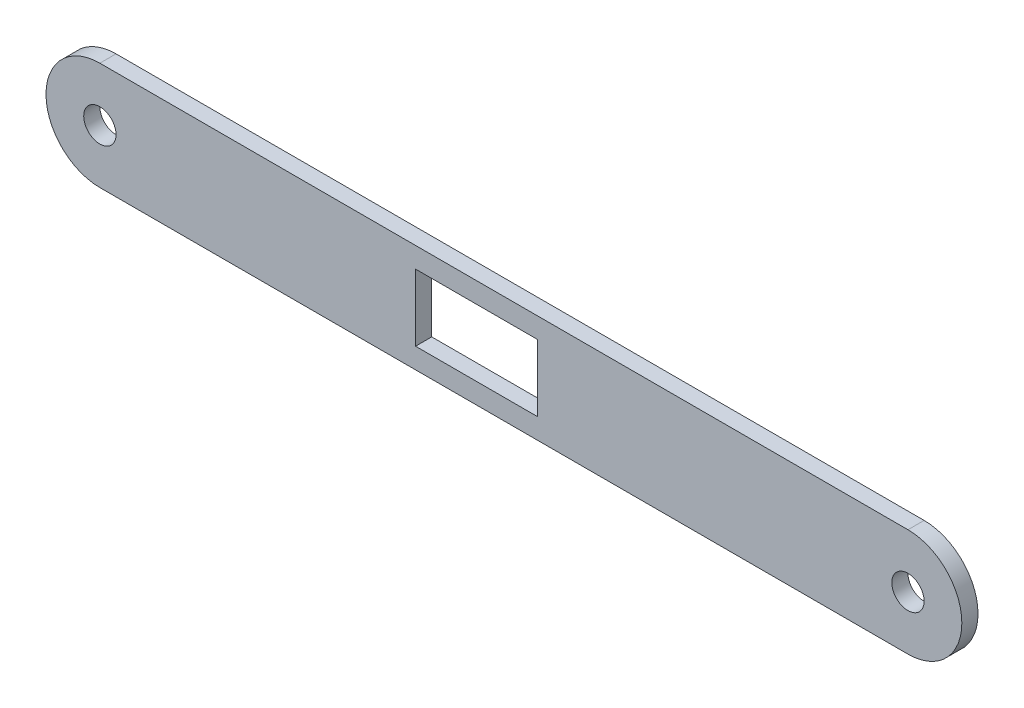
ISO-10303-21;
HEADER;
FILE_DESCRIPTION(('STEP AP214'),'2;1');
FILE_NAME('part.step','',(''),(''),'','','');
FILE_SCHEMA(('AUTOMOTIVE_DESIGN { 1 0 10303 214 1 1 1 1 }'));
ENDSEC;
DATA;
#1=APPLICATION_CONTEXT('core data for automotive mechanical design processes');
#2=APPLICATION_PROTOCOL_DEFINITION('international standard','automotive_design',2000,#1);
#3=PRODUCT_CONTEXT('',#1,'mechanical');
#4=PRODUCT('Part','Part','',(#3));
#5=PRODUCT_RELATED_PRODUCT_CATEGORY('part','',(#4));
#6=PRODUCT_DEFINITION_FORMATION('','',#4);
#7=PRODUCT_DEFINITION_CONTEXT('part definition',#1,'design');
#8=PRODUCT_DEFINITION('design','',#6,#7);
#9=PRODUCT_DEFINITION_SHAPE('','',#8);
#10=(LENGTH_UNIT() NAMED_UNIT(*) SI_UNIT(.MILLI.,.METRE.));
#11=(NAMED_UNIT(*) PLANE_ANGLE_UNIT() SI_UNIT($,.RADIAN.));
#12=(NAMED_UNIT(*) SI_UNIT($,.STERADIAN.) SOLID_ANGLE_UNIT());
#13=UNCERTAINTY_MEASURE_WITH_UNIT(LENGTH_MEASURE(1.E-05),#10,'distance_accuracy_value','');
#14=(GEOMETRIC_REPRESENTATION_CONTEXT(3) GLOBAL_UNCERTAINTY_ASSIGNED_CONTEXT((#13)) GLOBAL_UNIT_ASSIGNED_CONTEXT((#10,
#11,#12)) REPRESENTATION_CONTEXT('',''));
#15=CARTESIAN_POINT('',(0.,0.,0.));
#16=DIRECTION('',(0.,0.,1.));
#17=DIRECTION('',(1.,0.,0.));
#18=AXIS2_PLACEMENT_3D('',#15,#16,#17);
#19=CARTESIAN_POINT('',(75.,0.,3.));
#20=DIRECTION('',(0.,0.,1.));
#21=DIRECTION('',(1.,0.,0.));
#22=AXIS2_PLACEMENT_3D('',#19,#20,#21);
#23=PLANE('',#22);
#24=CARTESIAN_POINT('',(75.,0.,3.));
#25=DIRECTION('',(0.,0.,1.));
#26=DIRECTION('',(1.,0.,0.));
#27=AXIS2_PLACEMENT_3D('',#24,#25,#26);
#28=CIRCLE('',#27,3.00000000000001);
#29=CARTESIAN_POINT('',(78.,0.,3.));
#30=VERTEX_POINT('',#29);
#31=EDGE_CURVE('E167',#30,#30,#28,.T.);
#32=ORIENTED_EDGE('',*,*,#31,.F.);
#33=EDGE_LOOP('',(#32));
#34=FACE_BOUND('',#33,.T.);
#35=CARTESIAN_POINT('',(75.,0.,3.));
#36=DIRECTION('',(0.,0.,1.));
#37=DIRECTION('',(1.,0.,0.));
#38=AXIS2_PLACEMENT_3D('',#35,#36,#37);
#39=CIRCLE('',#38,10.);
#40=CARTESIAN_POINT('',(75.,-9.99999999999997,3.));
#41=VERTEX_POINT('',#40);
#42=CARTESIAN_POINT('',(75.,10.,3.));
#43=VERTEX_POINT('',#42);
#44=EDGE_CURVE('E175',#41,#43,#39,.T.);
#45=ORIENTED_EDGE('',*,*,#44,.T.);
#46=DIRECTION('',(-1.,0.,0.));
#47=VECTOR('',#46,1.);
#48=CARTESIAN_POINT('',(75.,10.,3.));
#49=LINE('',#48,#47);
#50=CARTESIAN_POINT('',(-75.,10.,3.));
#51=VERTEX_POINT('',#50);
#52=EDGE_CURVE('E179',#43,#51,#49,.T.);
#53=ORIENTED_EDGE('',*,*,#52,.T.);
#54=CARTESIAN_POINT('',(-75.,0.,3.));
#55=DIRECTION('',(0.,0.,1.));
#56=DIRECTION('',(1.,0.,0.));
#57=AXIS2_PLACEMENT_3D('',#54,#55,#56);
#58=CIRCLE('',#57,10.);
#59=CARTESIAN_POINT('',(-75.,-9.99999999999999,3.));
#60=VERTEX_POINT('',#59);
#61=EDGE_CURVE('E183',#51,#60,#58,.T.);
#62=ORIENTED_EDGE('',*,*,#61,.T.);
#63=DIRECTION('',(1.,0.,0.));
#64=VECTOR('',#63,1.);
#65=CARTESIAN_POINT('',(75.,-9.99999999999997,3.));
#66=LINE('',#65,#64);
#67=EDGE_CURVE('E186',#60,#41,#66,.T.);
#68=ORIENTED_EDGE('',*,*,#67,.T.);
#69=EDGE_LOOP('',(#45,#53,#62,#68));
#70=FACE_BOUND('',#69,.T.);
#71=CARTESIAN_POINT('',(-75.,0.,3.));
#72=DIRECTION('',(0.,0.,1.));
#73=DIRECTION('',(-1.,0.,0.));
#74=AXIS2_PLACEMENT_3D('',#71,#72,#73);
#75=CIRCLE('',#74,3.00000000000001);
#76=CARTESIAN_POINT('',(-78.,0.,3.));
#77=VERTEX_POINT('',#76);
#78=EDGE_CURVE('E159',#77,#77,#75,.T.);
#79=ORIENTED_EDGE('',*,*,#78,.F.);
#80=EDGE_LOOP('',(#79));
#81=FACE_BOUND('',#80,.T.);
#82=DIRECTION('',(-1.,0.,0.));
#83=VECTOR('',#82,1.);
#84=CARTESIAN_POINT('',(-16.4,6.2,3.));
#85=LINE('',#84,#83);
#86=CARTESIAN_POINT('',(6.2,6.2,3.));
#87=VERTEX_POINT('',#86);
#88=CARTESIAN_POINT('',(-16.4,6.2,3.));
#89=VERTEX_POINT('',#88);
#90=EDGE_CURVE('E118',#87,#89,#85,.T.);
#91=ORIENTED_EDGE('',*,*,#90,.F.);
#92=DIRECTION('',(0.,1.,0.));
#93=VECTOR('',#92,1.);
#94=CARTESIAN_POINT('',(6.2,6.2,3.));
#95=LINE('',#94,#93);
#96=CARTESIAN_POINT('',(6.2,-6.2,3.));
#97=VERTEX_POINT('',#96);
#98=EDGE_CURVE('E109',#97,#87,#95,.T.);
#99=ORIENTED_EDGE('',*,*,#98,.F.);
#100=DIRECTION('',(1.,0.,0.));
#101=VECTOR('',#100,1.);
#102=CARTESIAN_POINT('',(-16.4,-6.2,3.));
#103=LINE('',#102,#101);
#104=CARTESIAN_POINT('',(-16.4,-6.2,3.));
#105=VERTEX_POINT('',#104);
#106=EDGE_CURVE('E137',#105,#97,#103,.T.);
#107=ORIENTED_EDGE('',*,*,#106,.F.);
#108=DIRECTION('',(0.,-1.,0.));
#109=VECTOR('',#108,1.);
#110=CARTESIAN_POINT('',(-16.4,6.2,3.));
#111=LINE('',#110,#109);
#112=EDGE_CURVE('E131',#89,#105,#111,.T.);
#113=ORIENTED_EDGE('',*,*,#112,.F.);
#114=EDGE_LOOP('',(#91,#99,#107,#113));
#115=FACE_BOUND('',#114,.T.);
#116=ADVANCED_FACE('F43',(#34,#70,#81,#115),#23,.T.);
#117=CARTESIAN_POINT('',(75.,0.,0.));
#118=DIRECTION('',(0.,0.,1.));
#119=DIRECTION('',(1.,0.,0.));
#120=AXIS2_PLACEMENT_3D('',#117,#118,#119);
#121=PLANE('',#120);
#122=CARTESIAN_POINT('',(-75.,0.,0.));
#123=DIRECTION('',(0.,0.,1.));
#124=DIRECTION('',(-1.,0.,0.));
#125=AXIS2_PLACEMENT_3D('',#122,#123,#124);
#126=CIRCLE('',#125,3.00000000000001);
#127=CARTESIAN_POINT('',(-78.,0.,0.));
#128=VERTEX_POINT('',#127);
#129=EDGE_CURVE('E127',#128,#128,#126,.T.);
#130=ORIENTED_EDGE('',*,*,#129,.T.);
#131=EDGE_LOOP('',(#130));
#132=FACE_BOUND('',#131,.T.);
#133=CARTESIAN_POINT('',(75.,0.,0.));
#134=DIRECTION('',(0.,0.,1.));
#135=DIRECTION('',(1.,0.,0.));
#136=AXIS2_PLACEMENT_3D('',#133,#134,#135);
#137=CIRCLE('',#136,3.00000000000001);
#138=CARTESIAN_POINT('',(78.,0.,0.));
#139=VERTEX_POINT('',#138);
#140=EDGE_CURVE('E163',#139,#139,#137,.T.);
#141=ORIENTED_EDGE('',*,*,#140,.T.);
#142=EDGE_LOOP('',(#141));
#143=FACE_BOUND('',#142,.T.);
#144=CARTESIAN_POINT('',(75.,0.,0.));
#145=DIRECTION('',(0.,0.,1.));
#146=DIRECTION('',(1.,0.,0.));
#147=AXIS2_PLACEMENT_3D('',#144,#145,#146);
#148=CIRCLE('',#147,10.);
#149=CARTESIAN_POINT('',(75.,-9.99999999999997,0.));
#150=VERTEX_POINT('',#149);
#151=CARTESIAN_POINT('',(75.,10.,0.));
#152=VERTEX_POINT('',#151);
#153=EDGE_CURVE('E171',#150,#152,#148,.T.);
#154=ORIENTED_EDGE('',*,*,#153,.F.);
#155=DIRECTION('',(1.,0.,0.));
#156=VECTOR('',#155,1.);
#157=CARTESIAN_POINT('',(75.,-9.99999999999997,0.));
#158=LINE('',#157,#156);
#159=CARTESIAN_POINT('',(-75.,-9.99999999999999,0.));
#160=VERTEX_POINT('',#159);
#161=EDGE_CURVE('E180',#160,#150,#158,.T.);
#162=ORIENTED_EDGE('',*,*,#161,.F.);
#163=CARTESIAN_POINT('',(-75.,0.,0.));
#164=DIRECTION('',(0.,0.,1.));
#165=DIRECTION('',(1.,0.,0.));
#166=AXIS2_PLACEMENT_3D('',#163,#164,#165);
#167=CIRCLE('',#166,10.);
#168=CARTESIAN_POINT('',(-75.,10.,0.));
#169=VERTEX_POINT('',#168);
#170=EDGE_CURVE('E196',#169,#160,#167,.T.);
#171=ORIENTED_EDGE('',*,*,#170,.F.);
#172=DIRECTION('',(-1.,0.,0.));
#173=VECTOR('',#172,1.);
#174=CARTESIAN_POINT('',(75.,10.,0.));
#175=LINE('',#174,#173);
#176=EDGE_CURVE('E193',#152,#169,#175,.T.);
#177=ORIENTED_EDGE('',*,*,#176,.F.);
#178=EDGE_LOOP('',(#154,#162,#171,#177));
#179=FACE_BOUND('',#178,.T.);
#180=DIRECTION('',(0.,1.,0.));
#181=VECTOR('',#180,1.);
#182=CARTESIAN_POINT('',(6.2,6.2,0.));
#183=LINE('',#182,#181);
#184=CARTESIAN_POINT('',(6.2,-6.2,0.));
#185=VERTEX_POINT('',#184);
#186=CARTESIAN_POINT('',(6.2,6.2,0.));
#187=VERTEX_POINT('',#186);
#188=EDGE_CURVE('E67',#185,#187,#183,.T.);
#189=ORIENTED_EDGE('',*,*,#188,.T.);
#190=DIRECTION('',(-1.,0.,0.));
#191=VECTOR('',#190,1.);
#192=CARTESIAN_POINT('',(-16.4,6.2,0.));
#193=LINE('',#192,#191);
#194=CARTESIAN_POINT('',(-16.4,6.2,0.));
#195=VERTEX_POINT('',#194);
#196=EDGE_CURVE('E125',#187,#195,#193,.T.);
#197=ORIENTED_EDGE('',*,*,#196,.T.);
#198=DIRECTION('',(0.,-1.,0.));
#199=VECTOR('',#198,1.);
#200=CARTESIAN_POINT('',(-16.4,6.2,0.));
#201=LINE('',#200,#199);
#202=CARTESIAN_POINT('',(-16.4,-6.2,0.));
#203=VERTEX_POINT('',#202);
#204=EDGE_CURVE('E146',#195,#203,#201,.T.);
#205=ORIENTED_EDGE('',*,*,#204,.T.);
#206=DIRECTION('',(1.,0.,0.));
#207=VECTOR('',#206,1.);
#208=CARTESIAN_POINT('',(-16.4,-6.2,0.));
#209=LINE('',#208,#207);
#210=EDGE_CURVE('E119',#203,#185,#209,.T.);
#211=ORIENTED_EDGE('',*,*,#210,.T.);
#212=EDGE_LOOP('',(#189,#197,#205,#211));
#213=FACE_BOUND('',#212,.T.);
#214=ADVANCED_FACE('F221',(#132,#143,#179,#213),#121,.F.);
#215=CARTESIAN_POINT('',(75.,0.,3.));
#216=DIRECTION('',(0.,0.,-1.));
#217=DIRECTION('',(-1.,0.,0.));
#218=AXIS2_PLACEMENT_3D('',#215,#216,#217);
#219=CYLINDRICAL_SURFACE('',#218,10.);
#220=ORIENTED_EDGE('',*,*,#153,.T.);
#221=DIRECTION('',(0.,0.,-1.));
#222=VECTOR('',#221,1.);
#223=CARTESIAN_POINT('',(75.,10.,3.));
#224=LINE('',#223,#222);
#225=EDGE_CURVE('E11',#43,#152,#224,.T.);
#226=ORIENTED_EDGE('',*,*,#225,.F.);
#227=ORIENTED_EDGE('',*,*,#44,.F.);
#228=DIRECTION('',(0.,0.,-1.));
#229=VECTOR('',#228,1.);
#230=CARTESIAN_POINT('',(75.,-9.99999999999997,3.));
#231=LINE('',#230,#229);
#232=EDGE_CURVE('E189',#41,#150,#231,.T.);
#233=ORIENTED_EDGE('',*,*,#232,.T.);
#234=EDGE_LOOP('',(#220,#226,#227,#233));
#235=FACE_BOUND('',#234,.T.);
#236=ADVANCED_FACE('F45',(#235),#219,.T.);
#237=CARTESIAN_POINT('',(75.,10.,3.));
#238=DIRECTION('',(0.,-1.,0.));
#239=DIRECTION('',(0.,0.,-1.));
#240=AXIS2_PLACEMENT_3D('',#237,#238,#239);
#241=PLANE('',#240);
#242=ORIENTED_EDGE('',*,*,#176,.T.);
#243=DIRECTION('',(0.,0.,-1.));
#244=VECTOR('',#243,1.);
#245=CARTESIAN_POINT('',(-75.,10.,3.));
#246=LINE('',#245,#244);
#247=EDGE_CURVE('E52',#51,#169,#246,.T.);
#248=ORIENTED_EDGE('',*,*,#247,.F.);
#249=ORIENTED_EDGE('',*,*,#52,.F.);
#250=ORIENTED_EDGE('',*,*,#225,.T.);
#251=EDGE_LOOP('',(#242,#248,#249,#250));
#252=FACE_BOUND('',#251,.T.);
#253=ADVANCED_FACE('F232',(#252),#241,.F.);
#254=CARTESIAN_POINT('',(-75.,0.,3.));
#255=DIRECTION('',(0.,0.,-1.));
#256=DIRECTION('',(-1.,0.,0.));
#257=AXIS2_PLACEMENT_3D('',#254,#255,#256);
#258=CYLINDRICAL_SURFACE('',#257,10.);
#259=ORIENTED_EDGE('',*,*,#170,.T.);
#260=DIRECTION('',(0.,0.,-1.));
#261=VECTOR('',#260,1.);
#262=CARTESIAN_POINT('',(-75.,-9.99999999999999,3.));
#263=LINE('',#262,#261);
#264=EDGE_CURVE('E204',#60,#160,#263,.T.);
#265=ORIENTED_EDGE('',*,*,#264,.F.);
#266=ORIENTED_EDGE('',*,*,#61,.F.);
#267=ORIENTED_EDGE('',*,*,#247,.T.);
#268=EDGE_LOOP('',(#259,#265,#266,#267));
#269=FACE_BOUND('',#268,.T.);
#270=ADVANCED_FACE('F215',(#269),#258,.T.);
#271=CARTESIAN_POINT('',(75.,-9.99999999999997,3.));
#272=DIRECTION('',(0.,1.,0.));
#273=DIRECTION('',(-1.,0.,0.));
#274=AXIS2_PLACEMENT_3D('',#271,#272,#273);
#275=PLANE('',#274);
#276=ORIENTED_EDGE('',*,*,#161,.T.);
#277=ORIENTED_EDGE('',*,*,#232,.F.);
#278=ORIENTED_EDGE('',*,*,#67,.F.);
#279=ORIENTED_EDGE('',*,*,#264,.T.);
#280=EDGE_LOOP('',(#276,#277,#278,#279));
#281=FACE_BOUND('',#280,.T.);
#282=ADVANCED_FACE('F225',(#281),#275,.F.);
#283=CARTESIAN_POINT('',(75.,0.,3.));
#284=DIRECTION('',(0.,0.,-1.));
#285=DIRECTION('',(-1.,0.,0.));
#286=AXIS2_PLACEMENT_3D('',#283,#284,#285);
#287=CYLINDRICAL_SURFACE('',#286,3.00000000000001);
#288=ORIENTED_EDGE('',*,*,#31,.T.);
#289=EDGE_LOOP('',(#288));
#290=FACE_BOUND('',#289,.T.);
#291=ORIENTED_EDGE('',*,*,#140,.F.);
#292=EDGE_LOOP('',(#291));
#293=FACE_BOUND('',#292,.T.);
#294=ADVANCED_FACE('F249',(#290,#293),#287,.F.);
#295=CARTESIAN_POINT('',(-75.,0.,3.));
#296=DIRECTION('',(0.,0.,-1.));
#297=DIRECTION('',(-1.,0.,0.));
#298=AXIS2_PLACEMENT_3D('',#295,#296,#297);
#299=CYLINDRICAL_SURFACE('',#298,3.00000000000001);
#300=ORIENTED_EDGE('',*,*,#78,.T.);
#301=EDGE_LOOP('',(#300));
#302=FACE_BOUND('',#301,.T.);
#303=ORIENTED_EDGE('',*,*,#129,.F.);
#304=EDGE_LOOP('',(#303));
#305=FACE_BOUND('',#304,.T.);
#306=ADVANCED_FACE('F256',(#302,#305),#299,.F.);
#307=CARTESIAN_POINT('',(6.2,6.2,3.));
#308=DIRECTION('',(-1.,0.,0.));
#309=DIRECTION('',(0.,-1.,0.));
#310=AXIS2_PLACEMENT_3D('',#307,#308,#309);
#311=PLANE('',#310);
#312=ORIENTED_EDGE('',*,*,#188,.F.);
#313=DIRECTION('',(0.,0.,-1.));
#314=VECTOR('',#313,1.);
#315=CARTESIAN_POINT('',(6.2,-6.2,3.));
#316=LINE('',#315,#314);
#317=EDGE_CURVE('E113',#97,#185,#316,.T.);
#318=ORIENTED_EDGE('',*,*,#317,.F.);
#319=ORIENTED_EDGE('',*,*,#98,.T.);
#320=DIRECTION('',(0.,0.,-1.));
#321=VECTOR('',#320,1.);
#322=CARTESIAN_POINT('',(6.2,6.2,3.));
#323=LINE('',#322,#321);
#324=EDGE_CURVE('E112',#87,#187,#323,.T.);
#325=ORIENTED_EDGE('',*,*,#324,.T.);
#326=EDGE_LOOP('',(#312,#318,#319,#325));
#327=FACE_BOUND('',#326,.T.);
#328=ADVANCED_FACE('F111',(#327),#311,.T.);
#329=CARTESIAN_POINT('',(-16.4,6.2,3.));
#330=DIRECTION('',(0.,-1.,0.));
#331=DIRECTION('',(0.,0.,-1.));
#332=AXIS2_PLACEMENT_3D('',#329,#330,#331);
#333=PLANE('',#332);
#334=ORIENTED_EDGE('',*,*,#196,.F.);
#335=ORIENTED_EDGE('',*,*,#324,.F.);
#336=ORIENTED_EDGE('',*,*,#90,.T.);
#337=DIRECTION('',(0.,0.,-1.));
#338=VECTOR('',#337,1.);
#339=CARTESIAN_POINT('',(-16.4,6.2,3.));
#340=LINE('',#339,#338);
#341=EDGE_CURVE('E128',#89,#195,#340,.T.);
#342=ORIENTED_EDGE('',*,*,#341,.T.);
#343=EDGE_LOOP('',(#334,#335,#336,#342));
#344=FACE_BOUND('',#343,.T.);
#345=ADVANCED_FACE('F122',(#344),#333,.T.);
#346=CARTESIAN_POINT('',(-16.4,6.2,3.));
#347=DIRECTION('',(1.,0.,0.));
#348=DIRECTION('',(0.,1.,0.));
#349=AXIS2_PLACEMENT_3D('',#346,#347,#348);
#350=PLANE('',#349);
#351=ORIENTED_EDGE('',*,*,#204,.F.);
#352=ORIENTED_EDGE('',*,*,#341,.F.);
#353=ORIENTED_EDGE('',*,*,#112,.T.);
#354=DIRECTION('',(0.,0.,-1.));
#355=VECTOR('',#354,1.);
#356=CARTESIAN_POINT('',(-16.4,-6.2,3.));
#357=LINE('',#356,#355);
#358=EDGE_CURVE('E59',#105,#203,#357,.T.);
#359=ORIENTED_EDGE('',*,*,#358,.T.);
#360=EDGE_LOOP('',(#351,#352,#353,#359));
#361=FACE_BOUND('',#360,.T.);
#362=ADVANCED_FACE('F273',(#361),#350,.T.);
#363=CARTESIAN_POINT('',(-16.4,-6.2,3.));
#364=DIRECTION('',(0.,1.,0.));
#365=DIRECTION('',(0.,0.,1.));
#366=AXIS2_PLACEMENT_3D('',#363,#364,#365);
#367=PLANE('',#366);
#368=ORIENTED_EDGE('',*,*,#210,.F.);
#369=ORIENTED_EDGE('',*,*,#358,.F.);
#370=ORIENTED_EDGE('',*,*,#106,.T.);
#371=ORIENTED_EDGE('',*,*,#317,.T.);
#372=EDGE_LOOP('',(#368,#369,#370,#371));
#373=FACE_BOUND('',#372,.T.);
#374=ADVANCED_FACE('F276',(#373),#367,.T.);
#375=CLOSED_SHELL('',(#116,#214,#236,#253,#270,#282,#294,#306,#328,#345,#362,#374));
#376=MANIFOLD_SOLID_BREP('B2',#375);
#377=ADVANCED_BREP_SHAPE_REPRESENTATION('',(#18,#376),#14);
#378=SHAPE_DEFINITION_REPRESENTATION(#9,#377);
ENDSEC;
END-ISO-10303-21;
